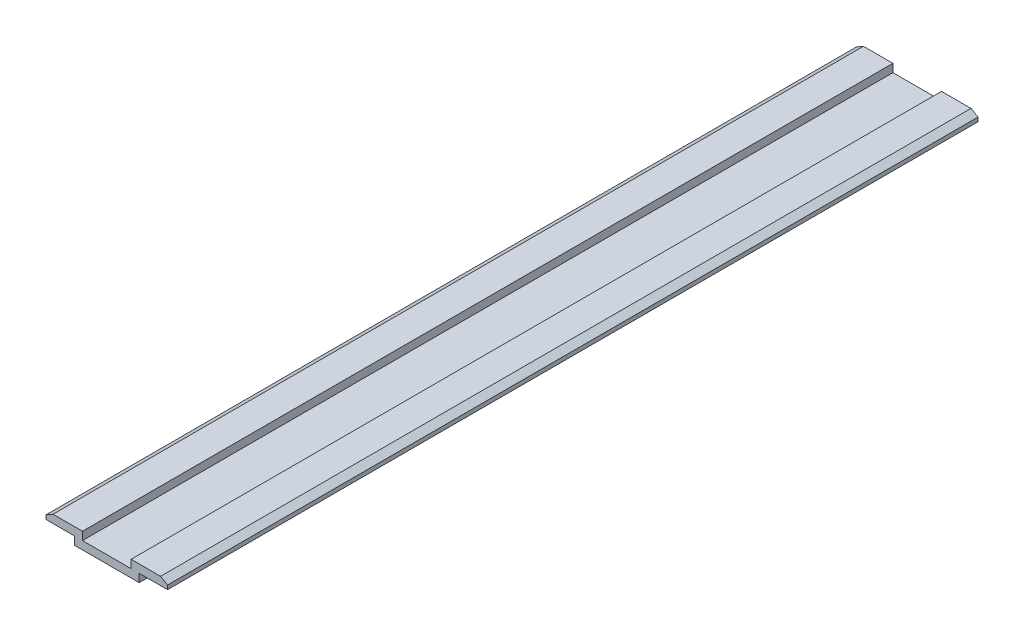
ISO-10303-21;
HEADER;
FILE_DESCRIPTION(('STEP AP214'),'2;1');
FILE_NAME('part.step','',(''),(''),'','','');
FILE_SCHEMA(('AUTOMOTIVE_DESIGN { 1 0 10303 214 1 1 1 1 }'));
ENDSEC;
DATA;
#1=APPLICATION_CONTEXT('core data for automotive mechanical design processes');
#2=APPLICATION_PROTOCOL_DEFINITION('international standard','automotive_design',2000,#1);
#3=PRODUCT_CONTEXT('',#1,'mechanical');
#4=PRODUCT('Part','Part','',(#3));
#5=PRODUCT_RELATED_PRODUCT_CATEGORY('part','',(#4));
#6=PRODUCT_DEFINITION_FORMATION('','',#4);
#7=PRODUCT_DEFINITION_CONTEXT('part definition',#1,'design');
#8=PRODUCT_DEFINITION('design','',#6,#7);
#9=PRODUCT_DEFINITION_SHAPE('','',#8);
#10=(LENGTH_UNIT() NAMED_UNIT(*) SI_UNIT(.MILLI.,.METRE.));
#11=(NAMED_UNIT(*) PLANE_ANGLE_UNIT() SI_UNIT($,.RADIAN.));
#12=(NAMED_UNIT(*) SI_UNIT($,.STERADIAN.) SOLID_ANGLE_UNIT());
#13=UNCERTAINTY_MEASURE_WITH_UNIT(LENGTH_MEASURE(1.E-05),#10,'distance_accuracy_value','');
#14=(GEOMETRIC_REPRESENTATION_CONTEXT(3) GLOBAL_UNCERTAINTY_ASSIGNED_CONTEXT((#13)) GLOBAL_UNIT_ASSIGNED_CONTEXT((#10,
#11,#12)) REPRESENTATION_CONTEXT('',''));
#15=CARTESIAN_POINT('',(0.,0.,0.));
#16=DIRECTION('',(0.,0.,1.));
#17=DIRECTION('',(1.,0.,0.));
#18=AXIS2_PLACEMENT_3D('',#15,#16,#17);
#19=CARTESIAN_POINT('',(-4.,0.,100.));
#20=DIRECTION('',(1.,0.,0.));
#21=DIRECTION('',(0.,0.,-1.));
#22=AXIS2_PLACEMENT_3D('',#19,#20,#21);
#23=PLANE('',#22);
#24=DIRECTION('',(0.,-1.,0.));
#25=VECTOR('',#24,1.);
#26=CARTESIAN_POINT('',(-4.,0.,0.));
#27=LINE('',#26,#25);
#28=CARTESIAN_POINT('',(-4.,1.,0.));
#29=VERTEX_POINT('',#28);
#30=CARTESIAN_POINT('',(-4.,0.,0.));
#31=VERTEX_POINT('',#30);
#32=EDGE_CURVE('E164',#29,#31,#27,.T.);
#33=ORIENTED_EDGE('',*,*,#32,.T.);
#34=DIRECTION('',(0.,0.,-1.));
#35=VECTOR('',#34,1.);
#36=CARTESIAN_POINT('',(-4.,0.,100.));
#37=LINE('',#36,#35);
#38=CARTESIAN_POINT('',(-4.,0.,100.));
#39=VERTEX_POINT('',#38);
#40=EDGE_CURVE('E11',#39,#31,#37,.T.);
#41=ORIENTED_EDGE('',*,*,#40,.F.);
#42=DIRECTION('',(0.,-1.,0.));
#43=VECTOR('',#42,1.);
#44=CARTESIAN_POINT('',(-4.,0.,100.));
#45=LINE('',#44,#43);
#46=CARTESIAN_POINT('',(-4.,1.,100.));
#47=VERTEX_POINT('',#46);
#48=EDGE_CURVE('E190',#47,#39,#45,.T.);
#49=ORIENTED_EDGE('',*,*,#48,.F.);
#50=DIRECTION('',(0.,0.,-1.));
#51=VECTOR('',#50,1.);
#52=CARTESIAN_POINT('',(-4.,1.,100.));
#53=LINE('',#52,#51);
#54=EDGE_CURVE('E160',#47,#29,#53,.T.);
#55=ORIENTED_EDGE('',*,*,#54,.T.);
#56=EDGE_LOOP('',(#33,#41,#49,#55));
#57=FACE_BOUND('',#56,.T.);
#58=ADVANCED_FACE('F32',(#57),#23,.F.);
#59=CARTESIAN_POINT('',(4.,0.,100.));
#60=DIRECTION('',(0.,1.,0.));
#61=DIRECTION('',(0.,0.,1.));
#62=AXIS2_PLACEMENT_3D('',#59,#60,#61);
#63=PLANE('',#62);
#64=DIRECTION('',(1.,0.,0.));
#65=VECTOR('',#64,1.);
#66=CARTESIAN_POINT('',(4.,0.,0.));
#67=LINE('',#66,#65);
#68=CARTESIAN_POINT('',(4.,0.,0.));
#69=VERTEX_POINT('',#68);
#70=EDGE_CURVE('E167',#31,#69,#67,.T.);
#71=ORIENTED_EDGE('',*,*,#70,.T.);
#72=DIRECTION('',(0.,0.,-1.));
#73=VECTOR('',#72,1.);
#74=CARTESIAN_POINT('',(4.,0.,100.));
#75=LINE('',#74,#73);
#76=CARTESIAN_POINT('',(4.,0.,100.));
#77=VERTEX_POINT('',#76);
#78=EDGE_CURVE('E40',#77,#69,#75,.T.);
#79=ORIENTED_EDGE('',*,*,#78,.F.);
#80=DIRECTION('',(1.,0.,0.));
#81=VECTOR('',#80,1.);
#82=CARTESIAN_POINT('',(4.,0.,100.));
#83=LINE('',#82,#81);
#84=EDGE_CURVE('E109',#39,#77,#83,.T.);
#85=ORIENTED_EDGE('',*,*,#84,.F.);
#86=ORIENTED_EDGE('',*,*,#40,.T.);
#87=EDGE_LOOP('',(#71,#79,#85,#86));
#88=FACE_BOUND('',#87,.T.);
#89=ADVANCED_FACE('F278',(#88),#63,.F.);
#90=CARTESIAN_POINT('',(4.,0.,100.));
#91=DIRECTION('',(-1.,0.,0.));
#92=DIRECTION('',(0.,0.,1.));
#93=AXIS2_PLACEMENT_3D('',#90,#91,#92);
#94=PLANE('',#93);
#95=DIRECTION('',(0.,1.,0.));
#96=VECTOR('',#95,1.);
#97=CARTESIAN_POINT('',(4.,0.,0.));
#98=LINE('',#97,#96);
#99=CARTESIAN_POINT('',(4.,1.,0.));
#100=VERTEX_POINT('',#99);
#101=EDGE_CURVE('E169',#69,#100,#98,.T.);
#102=ORIENTED_EDGE('',*,*,#101,.T.);
#103=DIRECTION('',(0.,0.,-1.));
#104=VECTOR('',#103,1.);
#105=CARTESIAN_POINT('',(4.,1.,100.));
#106=LINE('',#105,#104);
#107=CARTESIAN_POINT('',(4.,1.,100.));
#108=VERTEX_POINT('',#107);
#109=EDGE_CURVE('E215',#108,#100,#106,.T.);
#110=ORIENTED_EDGE('',*,*,#109,.F.);
#111=DIRECTION('',(0.,1.,0.));
#112=VECTOR('',#111,1.);
#113=CARTESIAN_POINT('',(4.,0.,100.));
#114=LINE('',#113,#112);
#115=EDGE_CURVE('E223',#77,#108,#114,.T.);
#116=ORIENTED_EDGE('',*,*,#115,.F.);
#117=ORIENTED_EDGE('',*,*,#78,.T.);
#118=EDGE_LOOP('',(#102,#110,#116,#117));
#119=FACE_BOUND('',#118,.T.);
#120=ADVANCED_FACE('F221',(#119),#94,.F.);
#121=CARTESIAN_POINT('',(4.,1.,100.));
#122=DIRECTION('',(0.,1.,0.));
#123=DIRECTION('',(-1.,0.,0.));
#124=AXIS2_PLACEMENT_3D('',#121,#122,#123);
#125=PLANE('',#124);
#126=DIRECTION('',(1.,0.,0.));
#127=VECTOR('',#126,1.);
#128=CARTESIAN_POINT('',(4.,1.,0.));
#129=LINE('',#128,#127);
#130=CARTESIAN_POINT('',(7.5,0.999999999999999,0.));
#131=VERTEX_POINT('',#130);
#132=EDGE_CURVE('E171',#100,#131,#129,.T.);
#133=ORIENTED_EDGE('',*,*,#132,.T.);
#134=DIRECTION('',(0.,0.,-1.));
#135=VECTOR('',#134,1.);
#136=CARTESIAN_POINT('',(7.5,0.999999999999999,100.));
#137=LINE('',#136,#135);
#138=CARTESIAN_POINT('',(7.5,0.999999999999999,100.));
#139=VERTEX_POINT('',#138);
#140=EDGE_CURVE('E212',#139,#131,#137,.T.);
#141=ORIENTED_EDGE('',*,*,#140,.F.);
#142=DIRECTION('',(1.,0.,0.));
#143=VECTOR('',#142,1.);
#144=CARTESIAN_POINT('',(4.,1.,100.));
#145=LINE('',#144,#143);
#146=EDGE_CURVE('E241',#108,#139,#145,.T.);
#147=ORIENTED_EDGE('',*,*,#146,.F.);
#148=ORIENTED_EDGE('',*,*,#109,.T.);
#149=EDGE_LOOP('',(#133,#141,#147,#148));
#150=FACE_BOUND('',#149,.T.);
#151=ADVANCED_FACE('F232',(#150),#125,.F.);
#152=CARTESIAN_POINT('',(7.5,0.999999999999999,100.));
#153=DIRECTION('',(-1.,0.,0.));
#154=DIRECTION('',(0.,0.,1.));
#155=AXIS2_PLACEMENT_3D('',#152,#153,#154);
#156=PLANE('',#155);
#157=DIRECTION('',(0.,1.,0.));
#158=VECTOR('',#157,1.);
#159=CARTESIAN_POINT('',(7.5,0.999999999999999,0.));
#160=LINE('',#159,#158);
#161=CARTESIAN_POINT('',(7.5,1.5,0.));
#162=VERTEX_POINT('',#161);
#163=EDGE_CURVE('E173',#131,#162,#160,.T.);
#164=ORIENTED_EDGE('',*,*,#163,.T.);
#165=DIRECTION('',(0.,0.,-1.));
#166=VECTOR('',#165,1.);
#167=CARTESIAN_POINT('',(7.5,1.5,100.));
#168=LINE('',#167,#166);
#169=CARTESIAN_POINT('',(7.5,1.5,100.));
#170=VERTEX_POINT('',#169);
#171=EDGE_CURVE('E209',#170,#162,#168,.T.);
#172=ORIENTED_EDGE('',*,*,#171,.F.);
#173=DIRECTION('',(0.,1.,0.));
#174=VECTOR('',#173,1.);
#175=CARTESIAN_POINT('',(7.5,0.999999999999999,100.));
#176=LINE('',#175,#174);
#177=EDGE_CURVE('E238',#139,#170,#176,.T.);
#178=ORIENTED_EDGE('',*,*,#177,.F.);
#179=ORIENTED_EDGE('',*,*,#140,.T.);
#180=EDGE_LOOP('',(#164,#172,#178,#179));
#181=FACE_BOUND('',#180,.T.);
#182=ADVANCED_FACE('F236',(#181),#156,.F.);
#183=CARTESIAN_POINT('',(7.5,1.5,100.));
#184=DIRECTION('',(-0.500000000000002,-0.866025403784438,0.));
#185=DIRECTION('',(0.866025403784438,-0.500000000000002,0.));
#186=AXIS2_PLACEMENT_3D('',#183,#184,#185);
#187=PLANE('',#186);
#188=DIRECTION('',(-0.866025403784438,0.500000000000002,0.));
#189=VECTOR('',#188,1.);
#190=CARTESIAN_POINT('',(7.5,1.5,0.));
#191=LINE('',#190,#189);
#192=CARTESIAN_POINT('',(6.63397459621556,2.,0.));
#193=VERTEX_POINT('',#192);
#194=EDGE_CURVE('E175',#162,#193,#191,.T.);
#195=ORIENTED_EDGE('',*,*,#194,.T.);
#196=DIRECTION('',(0.,0.,-1.));
#197=VECTOR('',#196,1.);
#198=CARTESIAN_POINT('',(6.63397459621556,2.,100.));
#199=LINE('',#198,#197);
#200=CARTESIAN_POINT('',(6.63397459621556,2.,100.));
#201=VERTEX_POINT('',#200);
#202=EDGE_CURVE('E206',#201,#193,#199,.T.);
#203=ORIENTED_EDGE('',*,*,#202,.F.);
#204=DIRECTION('',(-0.866025403784438,0.500000000000002,0.));
#205=VECTOR('',#204,1.);
#206=CARTESIAN_POINT('',(7.5,1.5,100.));
#207=LINE('',#206,#205);
#208=EDGE_CURVE('E240',#170,#201,#207,.T.);
#209=ORIENTED_EDGE('',*,*,#208,.F.);
#210=ORIENTED_EDGE('',*,*,#171,.T.);
#211=EDGE_LOOP('',(#195,#203,#209,#210));
#212=FACE_BOUND('',#211,.T.);
#213=ADVANCED_FACE('F291',(#212),#187,.F.);
#214=CARTESIAN_POINT('',(3.,2.,100.));
#215=DIRECTION('',(0.,-1.,0.));
#216=DIRECTION('',(1.,0.,0.));
#217=AXIS2_PLACEMENT_3D('',#214,#215,#216);
#218=PLANE('',#217);
#219=DIRECTION('',(-1.,0.,0.));
#220=VECTOR('',#219,1.);
#221=CARTESIAN_POINT('',(3.,2.,0.));
#222=LINE('',#221,#220);
#223=CARTESIAN_POINT('',(3.,2.,0.));
#224=VERTEX_POINT('',#223);
#225=EDGE_CURVE('E177',#193,#224,#222,.T.);
#226=ORIENTED_EDGE('',*,*,#225,.T.);
#227=DIRECTION('',(0.,0.,-1.));
#228=VECTOR('',#227,1.);
#229=CARTESIAN_POINT('',(3.,2.,100.));
#230=LINE('',#229,#228);
#231=CARTESIAN_POINT('',(3.,2.,100.));
#232=VERTEX_POINT('',#231);
#233=EDGE_CURVE('E203',#232,#224,#230,.T.);
#234=ORIENTED_EDGE('',*,*,#233,.F.);
#235=DIRECTION('',(-1.,0.,0.));
#236=VECTOR('',#235,1.);
#237=CARTESIAN_POINT('',(3.,2.,100.));
#238=LINE('',#237,#236);
#239=EDGE_CURVE('E243',#201,#232,#238,.T.);
#240=ORIENTED_EDGE('',*,*,#239,.F.);
#241=ORIENTED_EDGE('',*,*,#202,.T.);
#242=EDGE_LOOP('',(#226,#234,#240,#241));
#243=FACE_BOUND('',#242,.T.);
#244=ADVANCED_FACE('F294',(#243),#218,.F.);
#245=CARTESIAN_POINT('',(3.,1.,100.));
#246=DIRECTION('',(1.,0.,0.));
#247=DIRECTION('',(0.,1.,0.));
#248=AXIS2_PLACEMENT_3D('',#245,#246,#247);
#249=PLANE('',#248);
#250=DIRECTION('',(0.,-1.,0.));
#251=VECTOR('',#250,1.);
#252=CARTESIAN_POINT('',(3.,1.,0.));
#253=LINE('',#252,#251);
#254=CARTESIAN_POINT('',(3.,1.,0.));
#255=VERTEX_POINT('',#254);
#256=EDGE_CURVE('E179',#224,#255,#253,.T.);
#257=ORIENTED_EDGE('',*,*,#256,.T.);
#258=DIRECTION('',(0.,0.,-1.));
#259=VECTOR('',#258,1.);
#260=CARTESIAN_POINT('',(3.,1.,100.));
#261=LINE('',#260,#259);
#262=CARTESIAN_POINT('',(3.,1.,100.));
#263=VERTEX_POINT('',#262);
#264=EDGE_CURVE('E200',#263,#255,#261,.T.);
#265=ORIENTED_EDGE('',*,*,#264,.F.);
#266=DIRECTION('',(0.,-1.,0.));
#267=VECTOR('',#266,1.);
#268=CARTESIAN_POINT('',(3.,1.,100.));
#269=LINE('',#268,#267);
#270=EDGE_CURVE('E249',#232,#263,#269,.T.);
#271=ORIENTED_EDGE('',*,*,#270,.F.);
#272=ORIENTED_EDGE('',*,*,#233,.T.);
#273=EDGE_LOOP('',(#257,#265,#271,#272));
#274=FACE_BOUND('',#273,.T.);
#275=ADVANCED_FACE('F298',(#274),#249,.F.);
#276=CARTESIAN_POINT('',(3.,1.,100.));
#277=DIRECTION('',(0.,-1.,0.));
#278=DIRECTION('',(0.,0.,-1.));
#279=AXIS2_PLACEMENT_3D('',#276,#277,#278);
#280=PLANE('',#279);
#281=DIRECTION('',(-1.,0.,0.));
#282=VECTOR('',#281,1.);
#283=CARTESIAN_POINT('',(3.,1.,0.));
#284=LINE('',#283,#282);
#285=CARTESIAN_POINT('',(-3.,1.,0.));
#286=VERTEX_POINT('',#285);
#287=EDGE_CURVE('E181',#255,#286,#284,.T.);
#288=ORIENTED_EDGE('',*,*,#287,.T.);
#289=DIRECTION('',(0.,0.,-1.));
#290=VECTOR('',#289,1.);
#291=CARTESIAN_POINT('',(-3.,1.,100.));
#292=LINE('',#291,#290);
#293=CARTESIAN_POINT('',(-3.,1.,100.));
#294=VERTEX_POINT('',#293);
#295=EDGE_CURVE('E197',#294,#286,#292,.T.);
#296=ORIENTED_EDGE('',*,*,#295,.F.);
#297=DIRECTION('',(-1.,0.,0.));
#298=VECTOR('',#297,1.);
#299=CARTESIAN_POINT('',(3.,1.,100.));
#300=LINE('',#299,#298);
#301=EDGE_CURVE('E251',#263,#294,#300,.T.);
#302=ORIENTED_EDGE('',*,*,#301,.F.);
#303=ORIENTED_EDGE('',*,*,#264,.T.);
#304=EDGE_LOOP('',(#288,#296,#302,#303));
#305=FACE_BOUND('',#304,.T.);
#306=ADVANCED_FACE('F302',(#305),#280,.F.);
#307=CARTESIAN_POINT('',(-3.,1.,100.));
#308=DIRECTION('',(-1.,0.,0.));
#309=DIRECTION('',(0.,-1.,0.));
#310=AXIS2_PLACEMENT_3D('',#307,#308,#309);
#311=PLANE('',#310);
#312=DIRECTION('',(0.,1.,0.));
#313=VECTOR('',#312,1.);
#314=CARTESIAN_POINT('',(-3.,1.,0.));
#315=LINE('',#314,#313);
#316=CARTESIAN_POINT('',(-3.,2.,0.));
#317=VERTEX_POINT('',#316);
#318=EDGE_CURVE('E183',#286,#317,#315,.T.);
#319=ORIENTED_EDGE('',*,*,#318,.T.);
#320=DIRECTION('',(0.,0.,-1.));
#321=VECTOR('',#320,1.);
#322=CARTESIAN_POINT('',(-3.,2.,100.));
#323=LINE('',#322,#321);
#324=CARTESIAN_POINT('',(-3.,2.,100.));
#325=VERTEX_POINT('',#324);
#326=EDGE_CURVE('E194',#325,#317,#323,.T.);
#327=ORIENTED_EDGE('',*,*,#326,.F.);
#328=DIRECTION('',(0.,1.,0.));
#329=VECTOR('',#328,1.);
#330=CARTESIAN_POINT('',(-3.,1.,100.));
#331=LINE('',#330,#329);
#332=EDGE_CURVE('E253',#294,#325,#331,.T.);
#333=ORIENTED_EDGE('',*,*,#332,.F.);
#334=ORIENTED_EDGE('',*,*,#295,.T.);
#335=EDGE_LOOP('',(#319,#327,#333,#334));
#336=FACE_BOUND('',#335,.T.);
#337=ADVANCED_FACE('F259',(#336),#311,.F.);
#338=CARTESIAN_POINT('',(-3.,2.,100.));
#339=DIRECTION('',(0.,-1.,0.));
#340=DIRECTION('',(1.,0.,0.));
#341=AXIS2_PLACEMENT_3D('',#338,#339,#340);
#342=PLANE('',#341);
#343=DIRECTION('',(-1.,0.,0.));
#344=VECTOR('',#343,1.);
#345=CARTESIAN_POINT('',(-3.,2.,0.));
#346=LINE('',#345,#344);
#347=CARTESIAN_POINT('',(-6.63397459621556,2.,0.));
#348=VERTEX_POINT('',#347);
#349=EDGE_CURVE('E185',#317,#348,#346,.T.);
#350=ORIENTED_EDGE('',*,*,#349,.T.);
#351=DIRECTION('',(0.,0.,-1.));
#352=VECTOR('',#351,1.);
#353=CARTESIAN_POINT('',(-6.63397459621556,2.,100.));
#354=LINE('',#353,#352);
#355=CARTESIAN_POINT('',(-6.63397459621556,2.,100.));
#356=VERTEX_POINT('',#355);
#357=EDGE_CURVE('E155',#356,#348,#354,.T.);
#358=ORIENTED_EDGE('',*,*,#357,.F.);
#359=DIRECTION('',(-1.,0.,0.));
#360=VECTOR('',#359,1.);
#361=CARTESIAN_POINT('',(-3.,2.,100.));
#362=LINE('',#361,#360);
#363=EDGE_CURVE('E146',#325,#356,#362,.T.);
#364=ORIENTED_EDGE('',*,*,#363,.F.);
#365=ORIENTED_EDGE('',*,*,#326,.T.);
#366=EDGE_LOOP('',(#350,#358,#364,#365));
#367=FACE_BOUND('',#366,.T.);
#368=ADVANCED_FACE('F263',(#367),#342,.F.);
#369=CARTESIAN_POINT('',(-7.5,1.5,100.));
#370=DIRECTION('',(0.5,-0.866025403784439,0.));
#371=DIRECTION('',(0.866025403784439,0.5,0.));
#372=AXIS2_PLACEMENT_3D('',#369,#370,#371);
#373=PLANE('',#372);
#374=DIRECTION('',(-0.866025403784439,-0.5,0.));
#375=VECTOR('',#374,1.);
#376=CARTESIAN_POINT('',(-7.5,1.5,0.));
#377=LINE('',#376,#375);
#378=CARTESIAN_POINT('',(-7.5,1.5,0.));
#379=VERTEX_POINT('',#378);
#380=EDGE_CURVE('E154',#348,#379,#377,.T.);
#381=ORIENTED_EDGE('',*,*,#380,.T.);
#382=DIRECTION('',(0.,0.,-1.));
#383=VECTOR('',#382,1.);
#384=CARTESIAN_POINT('',(-7.5,1.5,100.));
#385=LINE('',#384,#383);
#386=CARTESIAN_POINT('',(-7.5,1.5,100.));
#387=VERTEX_POINT('',#386);
#388=EDGE_CURVE('E151',#387,#379,#385,.T.);
#389=ORIENTED_EDGE('',*,*,#388,.F.);
#390=DIRECTION('',(-0.866025403784439,-0.5,0.));
#391=VECTOR('',#390,1.);
#392=CARTESIAN_POINT('',(-7.5,1.5,100.));
#393=LINE('',#392,#391);
#394=EDGE_CURVE('E140',#356,#387,#393,.T.);
#395=ORIENTED_EDGE('',*,*,#394,.F.);
#396=ORIENTED_EDGE('',*,*,#357,.T.);
#397=EDGE_LOOP('',(#381,#389,#395,#396));
#398=FACE_BOUND('',#397,.T.);
#399=ADVANCED_FACE('F152',(#398),#373,.F.);
#400=CARTESIAN_POINT('',(-7.5,0.999999999999999,100.));
#401=DIRECTION('',(1.,0.,0.));
#402=DIRECTION('',(0.,0.,-1.));
#403=AXIS2_PLACEMENT_3D('',#400,#401,#402);
#404=PLANE('',#403);
#405=DIRECTION('',(0.,-1.,0.));
#406=VECTOR('',#405,1.);
#407=CARTESIAN_POINT('',(-7.5,0.999999999999999,0.));
#408=LINE('',#407,#406);
#409=CARTESIAN_POINT('',(-7.5,0.999999999999999,0.));
#410=VERTEX_POINT('',#409);
#411=EDGE_CURVE('E95',#379,#410,#408,.T.);
#412=ORIENTED_EDGE('',*,*,#411,.T.);
#413=DIRECTION('',(0.,0.,-1.));
#414=VECTOR('',#413,1.);
#415=CARTESIAN_POINT('',(-7.5,0.999999999999999,100.));
#416=LINE('',#415,#414);
#417=CARTESIAN_POINT('',(-7.5,0.999999999999999,100.));
#418=VERTEX_POINT('',#417);
#419=EDGE_CURVE('E156',#418,#410,#416,.T.);
#420=ORIENTED_EDGE('',*,*,#419,.F.);
#421=DIRECTION('',(0.,-1.,0.));
#422=VECTOR('',#421,1.);
#423=CARTESIAN_POINT('',(-7.5,0.999999999999999,100.));
#424=LINE('',#423,#422);
#425=EDGE_CURVE('E144',#387,#418,#424,.T.);
#426=ORIENTED_EDGE('',*,*,#425,.F.);
#427=ORIENTED_EDGE('',*,*,#388,.T.);
#428=EDGE_LOOP('',(#412,#420,#426,#427));
#429=FACE_BOUND('',#428,.T.);
#430=ADVANCED_FACE('F158',(#429),#404,.F.);
#431=CARTESIAN_POINT('',(-4.,1.,100.));
#432=DIRECTION('',(0.,1.,0.));
#433=DIRECTION('',(-1.,0.,0.));
#434=AXIS2_PLACEMENT_3D('',#431,#432,#433);
#435=PLANE('',#434);
#436=DIRECTION('',(1.,0.,0.));
#437=VECTOR('',#436,1.);
#438=CARTESIAN_POINT('',(-4.,1.,0.));
#439=LINE('',#438,#437);
#440=EDGE_CURVE('E101',#410,#29,#439,.T.);
#441=ORIENTED_EDGE('',*,*,#440,.T.);
#442=ORIENTED_EDGE('',*,*,#54,.F.);
#443=DIRECTION('',(1.,0.,0.));
#444=VECTOR('',#443,1.);
#445=CARTESIAN_POINT('',(-4.,1.,100.));
#446=LINE('',#445,#444);
#447=EDGE_CURVE('E48',#418,#47,#446,.T.);
#448=ORIENTED_EDGE('',*,*,#447,.F.);
#449=ORIENTED_EDGE('',*,*,#419,.T.);
#450=EDGE_LOOP('',(#441,#442,#448,#449));
#451=FACE_BOUND('',#450,.T.);
#452=ADVANCED_FACE('F267',(#451),#435,.F.);
#453=CARTESIAN_POINT('',(0.,0.,100.));
#454=DIRECTION('',(0.,0.,1.));
#455=DIRECTION('',(1.,0.,0.));
#456=AXIS2_PLACEMENT_3D('',#453,#454,#455);
#457=PLANE('',#456);
#458=ORIENTED_EDGE('',*,*,#48,.T.);
#459=ORIENTED_EDGE('',*,*,#84,.T.);
#460=ORIENTED_EDGE('',*,*,#115,.T.);
#461=ORIENTED_EDGE('',*,*,#146,.T.);
#462=ORIENTED_EDGE('',*,*,#177,.T.);
#463=ORIENTED_EDGE('',*,*,#208,.T.);
#464=ORIENTED_EDGE('',*,*,#239,.T.);
#465=ORIENTED_EDGE('',*,*,#270,.T.);
#466=ORIENTED_EDGE('',*,*,#301,.T.);
#467=ORIENTED_EDGE('',*,*,#332,.T.);
#468=ORIENTED_EDGE('',*,*,#363,.T.);
#469=ORIENTED_EDGE('',*,*,#394,.T.);
#470=ORIENTED_EDGE('',*,*,#425,.T.);
#471=ORIENTED_EDGE('',*,*,#447,.T.);
#472=EDGE_LOOP('',(#458,#459,#460,#461,#462,#463,#464,#465,#466,#467,#468,#469,#470,#471));
#473=FACE_BOUND('',#472,.T.);
#474=ADVANCED_FACE('F142',(#473),#457,.T.);
#475=CARTESIAN_POINT('',(0.,0.,0.));
#476=DIRECTION('',(0.,0.,1.));
#477=DIRECTION('',(1.,0.,0.));
#478=AXIS2_PLACEMENT_3D('',#475,#476,#477);
#479=PLANE('',#478);
#480=ORIENTED_EDGE('',*,*,#32,.F.);
#481=ORIENTED_EDGE('',*,*,#440,.F.);
#482=ORIENTED_EDGE('',*,*,#411,.F.);
#483=ORIENTED_EDGE('',*,*,#380,.F.);
#484=ORIENTED_EDGE('',*,*,#349,.F.);
#485=ORIENTED_EDGE('',*,*,#318,.F.);
#486=ORIENTED_EDGE('',*,*,#287,.F.);
#487=ORIENTED_EDGE('',*,*,#256,.F.);
#488=ORIENTED_EDGE('',*,*,#225,.F.);
#489=ORIENTED_EDGE('',*,*,#194,.F.);
#490=ORIENTED_EDGE('',*,*,#163,.F.);
#491=ORIENTED_EDGE('',*,*,#132,.F.);
#492=ORIENTED_EDGE('',*,*,#101,.F.);
#493=ORIENTED_EDGE('',*,*,#70,.F.);
#494=EDGE_LOOP('',(#480,#481,#482,#483,#484,#485,#486,#487,#488,#489,#490,#491,#492,#493));
#495=FACE_BOUND('',#494,.T.);
#496=ADVANCED_FACE('F227',(#495),#479,.F.);
#497=CLOSED_SHELL('',(#58,#89,#120,#151,#182,#213,#244,#275,#306,#337,#368,#399,#430,#452,#474,#496));
#498=MANIFOLD_SOLID_BREP('B2',#497);
#499=ADVANCED_BREP_SHAPE_REPRESENTATION('',(#18,#498),#14);
#500=SHAPE_DEFINITION_REPRESENTATION(#9,#499);
ENDSEC;
END-ISO-10303-21;
